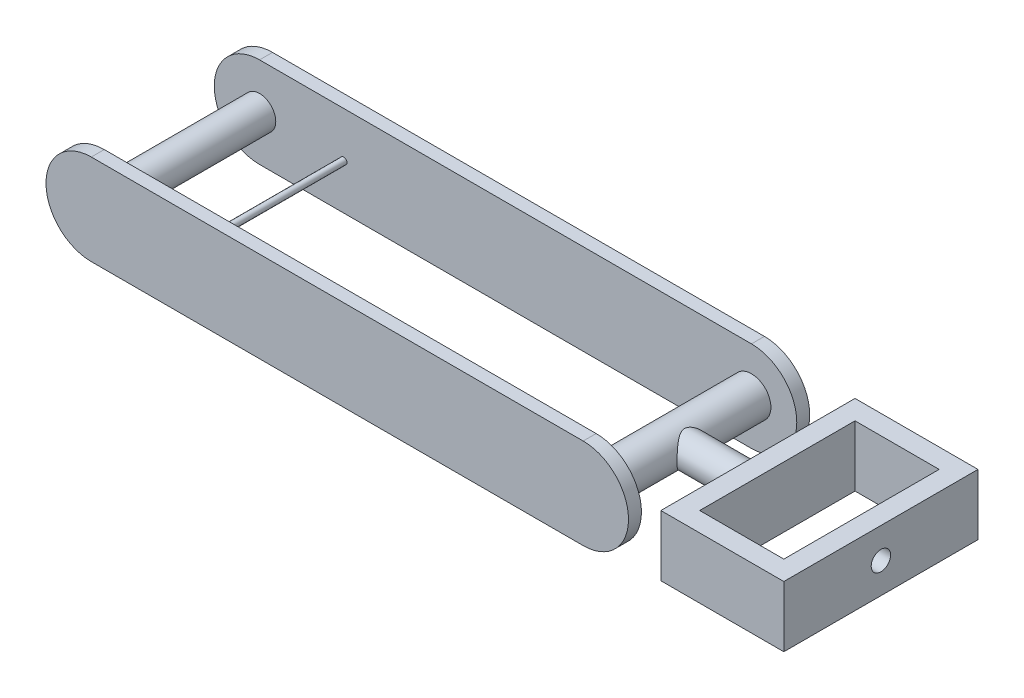
ISO-10303-21;
HEADER;
FILE_DESCRIPTION(('STEP AP214'),'2;1');
FILE_NAME('part.step','',(''),(''),'','','');
FILE_SCHEMA(('AUTOMOTIVE_DESIGN { 1 0 10303 214 1 1 1 1 }'));
ENDSEC;
DATA;
#1=APPLICATION_CONTEXT('core data for automotive mechanical design processes');
#2=APPLICATION_PROTOCOL_DEFINITION('international standard','automotive_design',2000,#1);
#3=PRODUCT_CONTEXT('',#1,'mechanical');
#4=PRODUCT('Part','Part','',(#3));
#5=PRODUCT_RELATED_PRODUCT_CATEGORY('part','',(#4));
#6=PRODUCT_DEFINITION_FORMATION('','',#4);
#7=PRODUCT_DEFINITION_CONTEXT('part definition',#1,'design');
#8=PRODUCT_DEFINITION('design','',#6,#7);
#9=PRODUCT_DEFINITION_SHAPE('','',#8);
#10=(LENGTH_UNIT() NAMED_UNIT(*) SI_UNIT(.MILLI.,.METRE.));
#11=(NAMED_UNIT(*) PLANE_ANGLE_UNIT() SI_UNIT($,.RADIAN.));
#12=(NAMED_UNIT(*) SI_UNIT($,.STERADIAN.) SOLID_ANGLE_UNIT());
#13=UNCERTAINTY_MEASURE_WITH_UNIT(LENGTH_MEASURE(1.E-05),#10,'distance_accuracy_value','');
#14=(GEOMETRIC_REPRESENTATION_CONTEXT(3) GLOBAL_UNCERTAINTY_ASSIGNED_CONTEXT((#13)) GLOBAL_UNIT_ASSIGNED_CONTEXT((#10,
#11,#12)) REPRESENTATION_CONTEXT('',''));
#15=CARTESIAN_POINT('',(0.,0.,0.));
#16=DIRECTION('',(0.,0.,1.));
#17=DIRECTION('',(1.,0.,0.));
#18=AXIS2_PLACEMENT_3D('',#15,#16,#17);
#19=CARTESIAN_POINT('',(270.,0.,0.));
#20=DIRECTION('',(1.,0.,0.));
#21=DIRECTION('',(0.,0.,-1.));
#22=AXIS2_PLACEMENT_3D('',#19,#20,#21);
#23=PLANE('',#22);
#24=DIRECTION('',(0.,0.,1.));
#25=VECTOR('',#24,1.);
#26=CARTESIAN_POINT('',(270.,23.5028857665654,15.));
#27=LINE('',#26,#25);
#28=CARTESIAN_POINT('',(270.,23.5028857665654,-120.));
#29=VERTEX_POINT('',#28);
#30=CARTESIAN_POINT('',(270.,23.5028857665654,0.));
#31=VERTEX_POINT('',#30);
#32=EDGE_CURVE('E55',#29,#31,#27,.T.);
#33=ORIENTED_EDGE('',*,*,#32,.T.);
#34=DIRECTION('',(0.,1.,0.));
#35=VECTOR('',#34,1.);
#36=CARTESIAN_POINT('',(270.,23.5028857665654,0.));
#37=LINE('',#36,#35);
#38=CARTESIAN_POINT('',(270.,-23.5028857665654,0.));
#39=VERTEX_POINT('',#38);
#40=EDGE_CURVE('E190',#39,#31,#37,.T.);
#41=ORIENTED_EDGE('',*,*,#40,.F.);
#42=DIRECTION('',(0.,0.,-1.));
#43=VECTOR('',#42,1.);
#44=CARTESIAN_POINT('',(270.,-23.5028857665654,15.));
#45=LINE('',#44,#43);
#46=CARTESIAN_POINT('',(270.,-23.5028857665654,-120.));
#47=VERTEX_POINT('',#46);
#48=EDGE_CURVE('E216',#39,#47,#45,.T.);
#49=ORIENTED_EDGE('',*,*,#48,.T.);
#50=DIRECTION('',(0.,-1.,0.));
#51=VECTOR('',#50,1.);
#52=CARTESIAN_POINT('',(270.,23.5028857665654,-120.));
#53=LINE('',#52,#51);
#54=EDGE_CURVE('E60',#29,#47,#53,.T.);
#55=ORIENTED_EDGE('',*,*,#54,.F.);
#56=EDGE_LOOP('',(#33,#41,#49,#55));
#57=FACE_BOUND('',#56,.T.);
#58=ADVANCED_FACE('F35',(#57),#23,.T.);
#59=CARTESIAN_POINT('',(190.,0.,-135.));
#60=DIRECTION('',(0.,0.,1.));
#61=DIRECTION('',(1.,0.,0.));
#62=AXIS2_PLACEMENT_3D('',#59,#60,#61);
#63=CYLINDRICAL_SURFACE('',#62,15.);
#64=CARTESIAN_POINT('',(190.,0.,0.));
#65=DIRECTION('',(0.,0.,1.));
#66=DIRECTION('',(1.,0.,0.));
#67=AXIS2_PLACEMENT_3D('',#64,#65,#66);
#68=CIRCLE('',#67,15.);
#69=CARTESIAN_POINT('',(205.,0.,0.));
#70=VERTEX_POINT('',#69);
#71=EDGE_CURVE('E239',#70,#70,#68,.T.);
#72=ORIENTED_EDGE('',*,*,#71,.F.);
#73=EDGE_LOOP('',(#72));
#74=FACE_BOUND('',#73,.T.);
#75=CARTESIAN_POINT('',(190.,0.,-120.));
#76=DIRECTION('',(0.,0.,1.));
#77=DIRECTION('',(1.,0.,0.));
#78=AXIS2_PLACEMENT_3D('',#75,#76,#77);
#79=CIRCLE('',#78,15.);
#80=CARTESIAN_POINT('',(205.,0.,-120.));
#81=VERTEX_POINT('',#80);
#82=EDGE_CURVE('E11',#81,#81,#79,.T.);
#83=ORIENTED_EDGE('',*,*,#82,.T.);
#84=EDGE_LOOP('',(#83));
#85=FACE_BOUND('',#84,.T.);
#86=CARTESIAN_POINT('',(205.,0.,-72.5));
#87=CARTESIAN_POINT('',(204.999998371701,-0.296923312070165,-72.4999983275979));
#88=CARTESIAN_POINT('',(204.991164705842,-0.593871646199195,-72.4894018329695));
#89=CARTESIAN_POINT('',(204.956034656178,-1.18524340872442,-72.447212805508));
#90=CARTESIAN_POINT('',(204.929736270144,-1.47966654370057,-72.4156178653242));
#91=CARTESIAN_POINT('',(204.860266269011,-2.06374265528194,-72.3319931563993));
#92=CARTESIAN_POINT('',(204.817084670112,-2.3533927035332,-72.2799512963895));
#93=CARTESIAN_POINT('',(204.714800764778,-2.92559798223802,-72.1563384657553));
#94=CARTESIAN_POINT('',(204.655698558575,-3.20815325734586,-72.0847676180794));
#95=CARTESIAN_POINT('',(204.523187659335,-3.76268614115294,-71.9237184026342));
#96=CARTESIAN_POINT('',(204.449867868628,-4.03471749052371,-71.8343512259831));
#97=CARTESIAN_POINT('',(204.290054677579,-4.56858722555234,-71.6386789994061));
#98=CARTESIAN_POINT('',(204.203561531421,-4.83042580775938,-71.5323742762918));
#99=CARTESIAN_POINT('',(204.018836277633,-5.34288544828468,-71.3040820620138));
#100=CARTESIAN_POINT('',(203.920603116742,-5.59350549734941,-71.1820931636612));
#101=CARTESIAN_POINT('',(203.713869708538,-6.08279150482866,-70.923654693615));
#102=CARTESIAN_POINT('',(203.605367280507,-6.32145490767388,-70.7872020497486));
#103=CARTESIAN_POINT('',(203.338075304108,-6.87172088229642,-70.4483850957328));
#104=CARTESIAN_POINT('',(203.17545453985,-7.17791172318053,-70.2402216276011));
#105=CARTESIAN_POINT('',(202.837441225209,-7.76629297181084,-69.801503500115));
#106=CARTESIAN_POINT('',(202.662044357147,-8.04847519535036,-69.5709412622383));
#107=CARTESIAN_POINT('',(202.301675653156,-8.58921346069624,-69.0888367923333));
#108=CARTESIAN_POINT('',(202.116680823637,-8.84770823448303,-68.837243203882));
#109=CARTESIAN_POINT('',(201.741232095059,-9.34019959391544,-68.3150163796984));
#110=CARTESIAN_POINT('',(201.550778885876,-9.57419925821835,-68.0443855438202));
#111=CARTESIAN_POINT('',(201.164774101581,-10.0218125911242,-67.4796720379531));
#112=CARTESIAN_POINT('',(200.969193193611,-10.2349719764474,-67.1852494985208));
#113=CARTESIAN_POINT('',(200.58102139351,-10.635779118778,-66.5774445965482));
#114=CARTESIAN_POINT('',(200.388431521636,-10.8234183329756,-66.2640559356271));
#115=CARTESIAN_POINT('',(200.01253413583,-11.1720493988886,-65.6186794298319));
#116=CARTESIAN_POINT('',(199.82920548693,-11.3331040206685,-65.2867379478547));
#117=CARTESIAN_POINT('',(199.478865642887,-11.6276971295169,-64.6027317422976));
#118=CARTESIAN_POINT('',(199.311840608889,-11.7612590616547,-64.2506844944784));
#119=CARTESIAN_POINT('',(199.073775103908,-11.9447893738676,-63.6899185196501));
#120=CARTESIAN_POINT('',(198.993522355246,-12.0052217887659,-63.4884952061355));
#121=CARTESIAN_POINT('',(198.842863185301,-12.1166220639299,-63.0793544531677));
#122=CARTESIAN_POINT('',(198.772458044519,-12.1675886936254,-62.8716361994374));
#123=CARTESIAN_POINT('',(198.643827527056,-12.2593021614932,-62.4506756462035));
#124=CARTESIAN_POINT('',(198.585578660217,-12.3000687406315,-62.2374449123401));
#125=CARTESIAN_POINT('',(198.483359359285,-12.3707917006533,-61.8059008705967));
#126=CARTESIAN_POINT('',(198.439381395281,-12.4007537833624,-61.5875903084262));
#127=CARTESIAN_POINT('',(198.367243446033,-12.4495452539764,-61.1441939469247));
#128=CARTESIAN_POINT('',(198.339293001597,-12.4682273289794,-60.9190572020046));
#129=CARTESIAN_POINT('',(198.301620086038,-12.4933433691716,-60.4665792166438));
#130=CARTESIAN_POINT('',(198.291895910489,-12.4997784796336,-60.2392381843352));
#131=CARTESIAN_POINT('',(198.291245052142,-12.5002102366344,-59.7845144251356));
#132=CARTESIAN_POINT('',(198.300318409853,-12.4942068563681,-59.5571316981558));
#133=CARTESIAN_POINT('',(198.336725509777,-12.4699428329516,-59.1044997815582));
#134=CARTESIAN_POINT('',(198.364061476269,-12.4516806967561,-58.8792508552143));
#135=CARTESIAN_POINT('',(198.438468977785,-12.4013871265877,-58.4142077314187));
#136=CARTESIAN_POINT('',(198.48698971129,-12.368339027623,-58.1747572105566));
#137=CARTESIAN_POINT('',(198.601004732832,-12.2893260258258,-57.7021912335421));
#138=CARTESIAN_POINT('',(198.666501695062,-12.2433590878467,-57.4690767818819));
#139=CARTESIAN_POINT('',(198.884358627522,-12.0871786252073,-56.7793302848718));
#140=CARTESIAN_POINT('',(199.057885667278,-11.9588103853178,-56.3333868775472));
#141=CARTESIAN_POINT('',(199.400121789437,-11.6908057009429,-55.5607980488661));
#142=CARTESIAN_POINT('',(199.562519884555,-11.5588798811882,-55.2284432487063));
#143=CARTESIAN_POINT('',(199.901095784922,-11.2702170140679,-54.5817415017133));
#144=CARTESIAN_POINT('',(200.077281639965,-11.1134654170124,-54.2674052631092));
#145=CARTESIAN_POINT('',(200.437296955341,-10.7760769566678,-53.6558428971152));
#146=CARTESIAN_POINT('',(200.621136440959,-10.595408043873,-53.3586405102075));
#147=CARTESIAN_POINT('',(200.991317792789,-10.2108848026406,-52.7814107881587));
#148=CARTESIAN_POINT('',(201.177659149809,-10.007035130802,-52.5013800208832));
#149=CARTESIAN_POINT('',(201.558551642437,-9.56500977328087,-51.9443476725589));
#150=CARTESIAN_POINT('',(201.75302208606,-9.32559600390717,-51.6682715308868));
#151=CARTESIAN_POINT('',(202.136161247921,-8.82121968518678,-51.1359999198117));
#152=CARTESIAN_POINT('',(202.324829099856,-8.55625334512574,-50.8798074103437));
#153=CARTESIAN_POINT('',(202.692071296891,-8.00136408219443,-50.3893275337445));
#154=CARTESIAN_POINT('',(202.870663962417,-7.71148904588991,-50.1549998648594));
#155=CARTESIAN_POINT('',(203.214230757941,-7.10668450823462,-49.709913033647));
#156=CARTESIAN_POINT('',(203.379209482823,-6.79176353127315,-49.4991459107381));
#157=CARTESIAN_POINT('',(203.653426023975,-6.2176346352411,-49.1522177018552));
#158=CARTESIAN_POINT('',(203.766432324652,-5.96362185269395,-49.0104125242363));
#159=CARTESIAN_POINT('',(203.980690039762,-5.44239412631551,-48.7431765404263));
#160=CARTESIAN_POINT('',(204.081944228038,-5.17518231915554,-48.617741869441));
#161=CARTESIAN_POINT('',(204.270949972049,-4.62856137888215,-48.3847232730962));
#162=CARTESIAN_POINT('',(204.35870605634,-4.34915637709623,-48.2771333599435));
#163=CARTESIAN_POINT('',(204.519079172758,-3.77940562745317,-48.0812406439891));
#164=CARTESIAN_POINT('',(204.591695959461,-3.48905970232378,-47.9929381538529));
#165=CARTESIAN_POINT('',(204.720744271192,-2.89692909479523,-47.8364360285027));
#166=CARTESIAN_POINT('',(204.777045797691,-2.59507312032774,-47.7683977436454));
#167=CARTESIAN_POINT('',(204.871374758826,-1.98435462821096,-47.6546040365546));
#168=CARTESIAN_POINT('',(204.909402152686,-1.67549209492938,-47.6088486640414));
#169=CARTESIAN_POINT('',(204.966206651751,-1.05361006429704,-47.5405577528012));
#170=CARTESIAN_POINT('',(204.984993910822,-0.740592848002751,-47.5180099663779));
#171=CARTESIAN_POINT('',(205.002854164801,-0.113203263560394,-47.4965736431341));
#172=CARTESIAN_POINT('',(205.001929304781,0.201168953414227,-47.4976825319952));
#173=CARTESIAN_POINT('',(204.981696161456,0.79060011548165,-47.5219692160475));
#174=CARTESIAN_POINT('',(204.964606254983,1.06585154136056,-47.5424839172527));
#175=CARTESIAN_POINT('',(204.915545079175,1.61305798508727,-47.6014616140286));
#176=CARTESIAN_POINT('',(204.883575238428,1.88501331681409,-47.6399228865922));
#177=CARTESIAN_POINT('',(204.805379076242,2.42381386934888,-47.734196250107));
#178=CARTESIAN_POINT('',(204.75915199851,2.69065881827185,-47.7900092615061));
#179=CARTESIAN_POINT('',(204.653297357706,3.21762543938395,-47.9181777733851));
#180=CARTESIAN_POINT('',(204.593669135482,3.47774678016148,-47.9905340875724));
#181=CARTESIAN_POINT('',(204.461177633125,3.99325659297312,-48.1518859617141));
#182=CARTESIAN_POINT('',(204.388151451925,4.24853866763172,-48.2410867687762));
#183=CARTESIAN_POINT('',(204.230551107354,4.74978694571594,-48.4344596218394));
#184=CARTESIAN_POINT('',(204.145972490854,4.99574950980776,-48.5386374418628));
#185=CARTESIAN_POINT('',(203.966533015729,5.47740828299168,-48.7608567076133));
#186=CARTESIAN_POINT('',(203.871672688143,5.71310502142153,-48.8788974373629));
#187=CARTESIAN_POINT('',(203.672916307246,6.17367827294099,-49.127822158771));
#188=CARTESIAN_POINT('',(203.569018442126,6.39855260229653,-49.2587087263898));
#189=CARTESIAN_POINT('',(203.30497565287,6.93563147461021,-49.5938796622724));
#190=CARTESIAN_POINT('',(203.140536431951,7.24166688197109,-49.8047152452547));
#191=CARTESIAN_POINT('',(202.799019650162,7.82947873887673,-50.2488422210337));
#192=CARTESIAN_POINT('',(202.621937235499,8.11124577906875,-50.4821422501745));
#193=CARTESIAN_POINT('',(202.258325526052,8.65098932350783,-50.9698800851125));
#194=CARTESIAN_POINT('',(202.071770882149,8.90889614562889,-51.2243759190458));
#195=CARTESIAN_POINT('',(201.693459865489,9.3999489168883,-51.7525164776672));
#196=CARTESIAN_POINT('',(201.501704230693,9.63309835598112,-52.0261584943444));
#197=CARTESIAN_POINT('',(201.113518601247,10.0786170078215,-52.596965368896));
#198=CARTESIAN_POINT('',(200.917066370513,10.2905396238018,-52.8944635737279));
#199=CARTESIAN_POINT('',(200.527648904049,10.6885973181745,-53.5086318812001));
#200=CARTESIAN_POINT('',(200.334684944672,10.8747231172231,-53.8253088240476));
#201=CARTESIAN_POINT('',(199.958812217844,11.2199362721708,-54.4774253786667));
#202=CARTESIAN_POINT('',(199.775877830386,11.3790949218183,-54.8128123003227));
#203=CARTESIAN_POINT('',(199.427359684749,11.6694553397696,-55.5039893073902));
#204=CARTESIAN_POINT('',(199.261760098837,11.8006827261947,-55.8597603133224));
#205=CARTESIAN_POINT('',(199.028151166414,11.9792820500161,-56.4237232519923));
#206=CARTESIAN_POINT('',(198.950307746211,12.0374486237396,-56.6244660664345));
#207=CARTESIAN_POINT('',(198.804668661434,12.1443795281648,-57.0320973860599));
#208=CARTESIAN_POINT('',(198.736874223358,12.1931427113827,-57.2389866377347));
#209=CARTESIAN_POINT('',(198.613629175613,12.2805172481157,-57.6580761260167));
#210=CARTESIAN_POINT('',(198.558153882382,12.3191489305144,-57.8702647771761));
#211=CARTESIAN_POINT('',(198.461568664994,12.3856895519206,-58.2994668784666));
#212=CARTESIAN_POINT('',(198.420451244776,12.4136040869729,-58.5164777478415));
#213=CARTESIAN_POINT('',(198.354063964567,12.4583809597523,-58.956791875045));
#214=CARTESIAN_POINT('',(198.328991692122,12.4751056097857,-59.1801394865725));
#215=CARTESIAN_POINT('',(198.296857243678,12.4965012122632,-59.6287044667341));
#216=CARTESIAN_POINT('',(198.289793555612,12.5011731766954,-59.8539216767967));
#217=CARTESIAN_POINT('',(198.294083772243,12.4983270737914,-60.3041518108093));
#218=CARTESIAN_POINT('',(198.305441723836,12.4908063279404,-60.5291646790035));
#219=CARTESIAN_POINT('',(198.345927219792,12.46379069103,-60.9768524618738));
#220=CARTESIAN_POINT('',(198.375057111794,12.4442942179972,-61.1995270637158));
#221=CARTESIAN_POINT('',(198.453508919613,12.3911519168957,-61.664241527745));
#222=CARTESIAN_POINT('',(198.504646881454,12.3562231793168,-61.905826173806));
#223=CARTESIAN_POINT('',(198.623944763418,12.2732581037799,-62.382372952829));
#224=CARTESIAN_POINT('',(198.692107781689,12.2252193799733,-62.6173338717625));
#225=CARTESIAN_POINT('',(198.917875966513,12.0625723366001,-63.3122628075375));
#226=CARTESIAN_POINT('',(199.096550881533,11.9295650271176,-63.7611856087824));
#227=CARTESIAN_POINT('',(199.447642704068,11.6525333453672,-64.5390132849835));
#228=CARTESIAN_POINT('',(199.613894699768,11.5162973775245,-64.8737139384393));
#229=CARTESIAN_POINT('',(199.959755387225,11.2185266211043,-65.5247367936715));
#230=CARTESIAN_POINT('',(200.139371812583,11.0569771235912,-65.8410481625492));
#231=CARTESIAN_POINT('',(200.50577305729,10.7094647902715,-66.4561875728671));
#232=CARTESIAN_POINT('',(200.692567186157,10.5234694360212,-66.7549915463219));
#233=CARTESIAN_POINT('',(201.06812719211,10.1277334392379,-67.3349985115838));
#234=CARTESIAN_POINT('',(201.256892664641,9.917997584994,-67.6162050349664));
#235=CARTESIAN_POINT('',(201.641548358718,9.46399415869409,-68.1742570726183));
#236=CARTESIAN_POINT('',(201.837332770365,9.21853603299082,-68.4502089646831));
#237=CARTESIAN_POINT('',(202.222384825024,8.70156411318117,-68.9816587133723));
#238=CARTESIAN_POINT('',(202.411651437901,8.43004622578964,-69.237153345115));
#239=CARTESIAN_POINT('',(202.779269062304,7.86159349217994,-69.7255066960116));
#240=CARTESIAN_POINT('',(202.957640159085,7.56470799324311,-69.9584075623967));
#241=CARTESIAN_POINT('',(203.299820096829,6.94548776625934,-70.3997411526791));
#242=CARTESIAN_POINT('',(203.463634491628,6.62316283354524,-70.6081832181838));
#243=CARTESIAN_POINT('',(203.732620016409,6.04067606389045,-70.947262061244));
#244=CARTESIAN_POINT('',(203.841992932701,5.78602780920789,-71.0840702241094));
#245=CARTESIAN_POINT('',(204.048825658988,5.26396034941812,-71.3413118620988));
#246=CARTESIAN_POINT('',(204.146288132655,4.99654401846071,-71.4617489991489));
#247=CARTESIAN_POINT('',(204.327547172101,4.45018573917794,-71.684725829009));
#248=CARTESIAN_POINT('',(204.411357085745,4.17125538649907,-71.7872830097129));
#249=CARTESIAN_POINT('',(204.563812809964,3.60303104563923,-71.9731982666466));
#250=CARTESIAN_POINT('',(204.632460726333,3.31373850312028,-72.0565590090701));
#251=CARTESIAN_POINT('',(204.742865044818,2.7766496606156,-72.190292660109));
#252=CARTESIAN_POINT('',(204.787210161234,2.53017700409103,-72.2438657904865));
#253=CARTESIAN_POINT('',(204.863772424159,2.03263262674723,-72.3362230677459));
#254=CARTESIAN_POINT('',(204.895991213844,1.7815615338768,-72.3750092183442));
#255=CARTESIAN_POINT('',(204.947766313573,1.2762377807826,-72.4372833672727));
#256=CARTESIAN_POINT('',(204.967323145443,1.02198525211293,-72.4607719960472));
#257=CARTESIAN_POINT('',(204.993441472234,0.511828141985505,-72.4921319727408));
#258=CARTESIAN_POINT('',(205.000001403459,0.255923365456328,-72.5000014414724));
#259=CARTESIAN_POINT('',(205.,0.,-72.5));
#260=B_SPLINE_CURVE_WITH_KNOTS('',3,(#86,#87,#88,#89,#90,#91,#92,#93,#94,#95,#96,#97,#98,#99,
#100,#101,#102,#103,#104,#105,#106,#107,#108,#109,#110,#111,#112,#113,#114,#115,#116,#117,#118,
#119,#120,#121,#122,#123,#124,#125,#126,#127,#128,#129,#130,#131,#132,#133,#134,#135,#136,#137,
#138,#139,#140,#141,#142,#143,#144,#145,#146,#147,#148,#149,#150,#151,#152,#153,#154,#155,#156,
#157,#158,#159,#160,#161,#162,#163,#164,#165,#166,#167,#168,#169,#170,#171,#172,#173,#174,#175,
#176,#177,#178,#179,#180,#181,#182,#183,#184,#185,#186,#187,#188,#189,#190,#191,#192,#193,#194,
#195,#196,#197,#198,#199,#200,#201,#202,#203,#204,#205,#206,#207,#208,#209,#210,#211,#212,#213,
#214,#215,#216,#217,#218,#219,#220,#221,#222,#223,#224,#225,#226,#227,#228,#229,#230,#231,#232,
#233,#234,#235,#236,#237,#238,#239,#240,#241,#242,#243,#244,#245,#246,#247,#248,#249,#250,#251,
#252,#253,#254,#255,#256,#257,#258,#259),.UNSPECIFIED.,.T.,.F.,(4,2,2,2,2,2,2,2,2,2,2,2,2,2,2,2,
2,2,2,2,2,2,2,2,2,2,2,2,2,2,2,2,2,2,2,2,2,2,2,2,2,2,2,2,2,2,2,2,2,2,2,2,2,2,2,2,2,2,2,2,2,2,2,2,
2,2,2,2,2,2,2,2,2,2,2,2,2,2,2,2,2,2,2,2,2,2,4),(0.,0.890496327722693,1.78109476332718,
2.67222064816241,3.56334092287135,4.44905895797117,5.33475990512299,6.2205403731543,
7.10650936389579,8.3179326410379,9.52976723481379,10.7446526556018,11.9593852002437,
13.1964670656074,14.4339620269412,15.6684919413966,16.9019646781947,17.5768149755148,
18.2517529433473,18.9253743663625,19.5986397790479,20.280517637783,20.9623317276903,
21.6441472869178,22.3260459023995,23.064518044577,23.803106585934,25.2835918051768,
26.4604393187565,27.6379791194065,28.8171131197453,29.9960106702444,31.2366027627229,
32.4773791805205,33.7158214234631,34.9538439515602,35.8892843253318,36.8245034567352,
37.7594081384926,38.694327974727,39.6365043057087,40.5786827389826,41.5203636865945,
42.4619421610537,43.2905793946019,44.1191370890495,44.9477387430364,45.7763811618238,
46.615861377997,47.4556661075397,48.2954274827628,49.1353575997355,50.3527496263854,
51.5706115562677,52.7919247494843,54.0130655496141,55.2560617222418,56.4995038575998,
57.7396055671636,58.9785649261597,59.6472285655574,60.3159737495773,60.9833666467615,
61.6504105838739,62.3255183093789,63.0005693484887,63.6757687040191,64.3510572714401,
65.0980707831754,65.8452203325021,67.342834782357,68.5348053464573,69.7274711152124,
70.9217397635807,72.1157679642777,73.3684812213695,74.6213915689275,75.8719178397659,
77.1219649287634,78.0483459197857,78.9745193526003,79.8997817756927,80.8249156114599,
81.5924932314998,82.3599668035974,83.1274087444327,83.8949430128885),.UNSPECIFIED.);
#261=CARTESIAN_POINT('',(205.,0.,-72.5));
#262=VERTEX_POINT('',#261);
#263=EDGE_CURVE('E39',#262,#262,#260,.T.);
#264=ORIENTED_EDGE('',*,*,#263,.T.);
#265=EDGE_LOOP('',(#264));
#266=FACE_BOUND('',#265,.T.);
#267=ADVANCED_FACE('F367',(#74,#85,#266),#63,.T.);
#268=CARTESIAN_POINT('',(-190.,0.,10.));
#269=DIRECTION('',(0.,0.,-1.));
#270=DIRECTION('',(-1.,0.,0.));
#271=AXIS2_PLACEMENT_3D('',#268,#269,#270);
#272=CYLINDRICAL_SURFACE('',#271,35.);
#273=CARTESIAN_POINT('',(-190.,0.,0.));
#274=DIRECTION('',(0.,0.,1.));
#275=DIRECTION('',(1.,0.,0.));
#276=AXIS2_PLACEMENT_3D('',#273,#274,#275);
#277=CIRCLE('',#276,35.);
#278=CARTESIAN_POINT('',(-190.,35.,0.));
#279=VERTEX_POINT('',#278);
#280=CARTESIAN_POINT('',(-190.,-35.,0.));
#281=VERTEX_POINT('',#280);
#282=EDGE_CURVE('E299',#279,#281,#277,.T.);
#283=ORIENTED_EDGE('',*,*,#282,.T.);
#284=DIRECTION('',(0.,0.,-1.));
#285=VECTOR('',#284,1.);
#286=CARTESIAN_POINT('',(-190.,-35.,10.));
#287=LINE('',#286,#285);
#288=CARTESIAN_POINT('',(-190.,-35.,10.));
#289=VERTEX_POINT('',#288);
#290=EDGE_CURVE('E315',#289,#281,#287,.T.);
#291=ORIENTED_EDGE('',*,*,#290,.F.);
#292=CARTESIAN_POINT('',(-190.,0.,10.));
#293=DIRECTION('',(0.,0.,1.));
#294=DIRECTION('',(1.,0.,0.));
#295=AXIS2_PLACEMENT_3D('',#292,#293,#294);
#296=CIRCLE('',#295,35.);
#297=CARTESIAN_POINT('',(-190.,35.,10.));
#298=VERTEX_POINT('',#297);
#299=EDGE_CURVE('E288',#298,#289,#296,.T.);
#300=ORIENTED_EDGE('',*,*,#299,.F.);
#301=DIRECTION('',(0.,0.,-1.));
#302=VECTOR('',#301,1.);
#303=CARTESIAN_POINT('',(-190.,35.,10.));
#304=LINE('',#303,#302);
#305=EDGE_CURVE('E298',#298,#279,#304,.T.);
#306=ORIENTED_EDGE('',*,*,#305,.T.);
#307=EDGE_LOOP('',(#283,#291,#300,#306));
#308=FACE_BOUND('',#307,.T.);
#309=ADVANCED_FACE('F37',(#308),#272,.T.);
#310=CARTESIAN_POINT('',(-190.,-35.,10.));
#311=DIRECTION('',(0.,1.,0.));
#312=DIRECTION('',(0.,0.,1.));
#313=AXIS2_PLACEMENT_3D('',#310,#311,#312);
#314=PLANE('',#313);
#315=DIRECTION('',(1.,0.,0.));
#316=VECTOR('',#315,1.);
#317=CARTESIAN_POINT('',(-190.,-35.,0.));
#318=LINE('',#317,#316);
#319=CARTESIAN_POINT('',(190.,-35.,0.));
#320=VERTEX_POINT('',#319);
#321=EDGE_CURVE('E302',#281,#320,#318,.T.);
#322=ORIENTED_EDGE('',*,*,#321,.T.);
#323=DIRECTION('',(0.,0.,-1.));
#324=VECTOR('',#323,1.);
#325=CARTESIAN_POINT('',(190.,-35.,10.));
#326=LINE('',#325,#324);
#327=CARTESIAN_POINT('',(190.,-35.,10.));
#328=VERTEX_POINT('',#327);
#329=EDGE_CURVE('E312',#328,#320,#326,.T.);
#330=ORIENTED_EDGE('',*,*,#329,.F.);
#331=DIRECTION('',(1.,0.,0.));
#332=VECTOR('',#331,1.);
#333=CARTESIAN_POINT('',(-190.,-35.,10.));
#334=LINE('',#333,#332);
#335=EDGE_CURVE('E291',#289,#328,#334,.T.);
#336=ORIENTED_EDGE('',*,*,#335,.F.);
#337=ORIENTED_EDGE('',*,*,#290,.T.);
#338=EDGE_LOOP('',(#322,#330,#336,#337));
#339=FACE_BOUND('',#338,.T.);
#340=ADVANCED_FACE('F455',(#339),#314,.F.);
#341=CARTESIAN_POINT('',(190.,0.,10.));
#342=DIRECTION('',(0.,0.,-1.));
#343=DIRECTION('',(-1.,0.,0.));
#344=AXIS2_PLACEMENT_3D('',#341,#342,#343);
#345=CYLINDRICAL_SURFACE('',#344,35.);
#346=CARTESIAN_POINT('',(190.,0.,0.));
#347=DIRECTION('',(0.,0.,1.));
#348=DIRECTION('',(1.,0.,0.));
#349=AXIS2_PLACEMENT_3D('',#346,#347,#348);
#350=CIRCLE('',#349,35.);
#351=CARTESIAN_POINT('',(190.,35.,0.));
#352=VERTEX_POINT('',#351);
#353=EDGE_CURVE('E304',#320,#352,#350,.T.);
#354=ORIENTED_EDGE('',*,*,#353,.T.);
#355=DIRECTION('',(0.,0.,-1.));
#356=VECTOR('',#355,1.);
#357=CARTESIAN_POINT('',(190.,35.,10.));
#358=LINE('',#357,#356);
#359=CARTESIAN_POINT('',(190.,35.,10.));
#360=VERTEX_POINT('',#359);
#361=EDGE_CURVE('E309',#360,#352,#358,.T.);
#362=ORIENTED_EDGE('',*,*,#361,.F.);
#363=CARTESIAN_POINT('',(190.,0.,10.));
#364=DIRECTION('',(0.,0.,1.));
#365=DIRECTION('',(1.,0.,0.));
#366=AXIS2_PLACEMENT_3D('',#363,#364,#365);
#367=CIRCLE('',#366,35.);
#368=EDGE_CURVE('E294',#328,#360,#367,.T.);
#369=ORIENTED_EDGE('',*,*,#368,.F.);
#370=ORIENTED_EDGE('',*,*,#329,.T.);
#371=EDGE_LOOP('',(#354,#362,#369,#370));
#372=FACE_BOUND('',#371,.T.);
#373=ADVANCED_FACE('F452',(#372),#345,.T.);
#374=CARTESIAN_POINT('',(-190.,35.,10.));
#375=DIRECTION('',(0.,-1.,0.));
#376=DIRECTION('',(0.,0.,-1.));
#377=AXIS2_PLACEMENT_3D('',#374,#375,#376);
#378=PLANE('',#377);
#379=DIRECTION('',(-1.,0.,0.));
#380=VECTOR('',#379,1.);
#381=CARTESIAN_POINT('',(-190.,35.,0.));
#382=LINE('',#381,#380);
#383=EDGE_CURVE('E292',#352,#279,#382,.T.);
#384=ORIENTED_EDGE('',*,*,#383,.T.);
#385=ORIENTED_EDGE('',*,*,#305,.F.);
#386=DIRECTION('',(-1.,0.,0.));
#387=VECTOR('',#386,1.);
#388=CARTESIAN_POINT('',(-190.,35.,10.));
#389=LINE('',#388,#387);
#390=EDGE_CURVE('E296',#360,#298,#389,.T.);
#391=ORIENTED_EDGE('',*,*,#390,.F.);
#392=ORIENTED_EDGE('',*,*,#361,.T.);
#393=EDGE_LOOP('',(#384,#385,#391,#392));
#394=FACE_BOUND('',#393,.T.);
#395=ADVANCED_FACE('F448',(#394),#378,.F.);
#396=CARTESIAN_POINT('',(-190.,0.,10.));
#397=DIRECTION('',(0.,0.,1.));
#398=DIRECTION('',(1.,0.,0.));
#399=AXIS2_PLACEMENT_3D('',#396,#397,#398);
#400=PLANE('',#399);
#401=ORIENTED_EDGE('',*,*,#299,.T.);
#402=ORIENTED_EDGE('',*,*,#335,.T.);
#403=ORIENTED_EDGE('',*,*,#368,.T.);
#404=ORIENTED_EDGE('',*,*,#390,.T.);
#405=EDGE_LOOP('',(#401,#402,#403,#404));
#406=FACE_BOUND('',#405,.T.);
#407=ADVANCED_FACE('F432',(#406),#400,.T.);
#408=CARTESIAN_POINT('',(-190.,0.,0.));
#409=DIRECTION('',(0.,0.,1.));
#410=DIRECTION('',(1.,0.,0.));
#411=AXIS2_PLACEMENT_3D('',#408,#409,#410);
#412=PLANE('',#411);
#413=ORIENTED_EDGE('',*,*,#71,.T.);
#414=EDGE_LOOP('',(#413));
#415=FACE_BOUND('',#414,.T.);
#416=CARTESIAN_POINT('',(-125.,0.,0.));
#417=DIRECTION('',(0.,0.,1.));
#418=DIRECTION('',(1.,0.,0.));
#419=AXIS2_PLACEMENT_3D('',#416,#417,#418);
#420=CIRCLE('',#419,2.5);
#421=CARTESIAN_POINT('',(-122.5,0.,0.));
#422=VERTEX_POINT('',#421);
#423=EDGE_CURVE('E248',#422,#422,#420,.T.);
#424=ORIENTED_EDGE('',*,*,#423,.T.);
#425=EDGE_LOOP('',(#424));
#426=FACE_BOUND('',#425,.T.);
#427=CARTESIAN_POINT('',(-190.,0.,0.));
#428=DIRECTION('',(0.,0.,1.));
#429=DIRECTION('',(1.,0.,0.));
#430=AXIS2_PLACEMENT_3D('',#427,#428,#429);
#431=CIRCLE('',#430,12.5);
#432=CARTESIAN_POINT('',(-177.5,0.,0.));
#433=VERTEX_POINT('',#432);
#434=EDGE_CURVE('E287',#433,#433,#431,.T.);
#435=ORIENTED_EDGE('',*,*,#434,.T.);
#436=EDGE_LOOP('',(#435));
#437=FACE_BOUND('',#436,.T.);
#438=ORIENTED_EDGE('',*,*,#282,.F.);
#439=ORIENTED_EDGE('',*,*,#383,.F.);
#440=ORIENTED_EDGE('',*,*,#353,.F.);
#441=ORIENTED_EDGE('',*,*,#321,.F.);
#442=EDGE_LOOP('',(#438,#439,#440,#441));
#443=FACE_BOUND('',#442,.T.);
#444=ADVANCED_FACE('F425',(#415,#426,#437,#443),#412,.F.);
#445=CARTESIAN_POINT('',(-190.,0.,-135.));
#446=DIRECTION('',(0.,0.,1.));
#447=DIRECTION('',(1.,0.,0.));
#448=AXIS2_PLACEMENT_3D('',#445,#446,#447);
#449=CYLINDRICAL_SURFACE('',#448,12.5);
#450=CARTESIAN_POINT('',(-190.,0.,-120.));
#451=DIRECTION('',(0.,0.,1.));
#452=DIRECTION('',(1.,0.,0.));
#453=AXIS2_PLACEMENT_3D('',#450,#451,#452);
#454=CIRCLE('',#453,12.5);
#455=CARTESIAN_POINT('',(-177.5,0.,-120.));
#456=VERTEX_POINT('',#455);
#457=EDGE_CURVE('E318',#456,#456,#454,.F.);
#458=ORIENTED_EDGE('',*,*,#457,.F.);
#459=EDGE_LOOP('',(#458));
#460=FACE_BOUND('',#459,.T.);
#461=ORIENTED_EDGE('',*,*,#434,.F.);
#462=EDGE_LOOP('',(#461));
#463=FACE_BOUND('',#462,.T.);
#464=ADVANCED_FACE('F416',(#460,#463),#449,.T.);
#465=CARTESIAN_POINT('',(-190.,0.,-130.));
#466=DIRECTION('',(0.,0.,1.));
#467=DIRECTION('',(1.,0.,0.));
#468=AXIS2_PLACEMENT_3D('',#465,#466,#467);
#469=CYLINDRICAL_SURFACE('',#468,34.9999999999999);
#470=CARTESIAN_POINT('',(-190.,0.,-120.));
#471=DIRECTION('',(0.,0.,1.));
#472=DIRECTION('',(1.,0.,0.));
#473=AXIS2_PLACEMENT_3D('',#470,#471,#472);
#474=CIRCLE('',#473,34.9999999999999);
#475=CARTESIAN_POINT('',(-190.,34.9999999999999,-120.));
#476=VERTEX_POINT('',#475);
#477=CARTESIAN_POINT('',(-190.,-34.9999999999999,-120.));
#478=VERTEX_POINT('',#477);
#479=EDGE_CURVE('E251',#476,#478,#474,.T.);
#480=ORIENTED_EDGE('',*,*,#479,.F.);
#481=DIRECTION('',(0.,0.,1.));
#482=VECTOR('',#481,1.);
#483=CARTESIAN_POINT('',(-190.,34.9999999999999,-130.));
#484=LINE('',#483,#482);
#485=CARTESIAN_POINT('',(-190.,34.9999999999999,-130.));
#486=VERTEX_POINT('',#485);
#487=EDGE_CURVE('E276',#486,#476,#484,.T.);
#488=ORIENTED_EDGE('',*,*,#487,.F.);
#489=CARTESIAN_POINT('',(-190.,0.,-130.));
#490=DIRECTION('',(0.,0.,1.));
#491=DIRECTION('',(1.,0.,0.));
#492=AXIS2_PLACEMENT_3D('',#489,#490,#491);
#493=CIRCLE('',#492,34.9999999999999);
#494=CARTESIAN_POINT('',(-190.,-34.9999999999999,-130.));
#495=VERTEX_POINT('',#494);
#496=EDGE_CURVE('E252',#486,#495,#493,.T.);
#497=ORIENTED_EDGE('',*,*,#496,.T.);
#498=DIRECTION('',(0.,0.,1.));
#499=VECTOR('',#498,1.);
#500=CARTESIAN_POINT('',(-190.,-34.9999999999999,-130.));
#501=LINE('',#500,#499);
#502=EDGE_CURVE('E265',#495,#478,#501,.T.);
#503=ORIENTED_EDGE('',*,*,#502,.T.);
#504=EDGE_LOOP('',(#480,#488,#497,#503));
#505=FACE_BOUND('',#504,.T.);
#506=ADVANCED_FACE('F344',(#505),#469,.T.);
#507=CARTESIAN_POINT('',(-190.,34.9999999999999,-130.));
#508=DIRECTION('',(0.,1.,0.));
#509=DIRECTION('',(-1.,0.,0.));
#510=AXIS2_PLACEMENT_3D('',#507,#508,#509);
#511=PLANE('',#510);
#512=DIRECTION('',(-1.,0.,0.));
#513=VECTOR('',#512,1.);
#514=CARTESIAN_POINT('',(-190.,34.9999999999999,-120.));
#515=LINE('',#514,#513);
#516=CARTESIAN_POINT('',(190.,35.,-120.));
#517=VERTEX_POINT('',#516);
#518=EDGE_CURVE('E256',#517,#476,#515,.T.);
#519=ORIENTED_EDGE('',*,*,#518,.F.);
#520=DIRECTION('',(0.,0.,1.));
#521=VECTOR('',#520,1.);
#522=CARTESIAN_POINT('',(190.,35.,-130.));
#523=LINE('',#522,#521);
#524=CARTESIAN_POINT('',(190.,35.,-130.));
#525=VERTEX_POINT('',#524);
#526=EDGE_CURVE('E279',#525,#517,#523,.T.);
#527=ORIENTED_EDGE('',*,*,#526,.F.);
#528=DIRECTION('',(-1.,0.,0.));
#529=VECTOR('',#528,1.);
#530=CARTESIAN_POINT('',(-190.,34.9999999999999,-130.));
#531=LINE('',#530,#529);
#532=EDGE_CURVE('E262',#525,#486,#531,.T.);
#533=ORIENTED_EDGE('',*,*,#532,.T.);
#534=ORIENTED_EDGE('',*,*,#487,.T.);
#535=EDGE_LOOP('',(#519,#527,#533,#534));
#536=FACE_BOUND('',#535,.T.);
#537=ADVANCED_FACE('F354',(#536),#511,.T.);
#538=CARTESIAN_POINT('',(190.,0.,-130.));
#539=DIRECTION('',(0.,0.,1.));
#540=DIRECTION('',(1.,0.,0.));
#541=AXIS2_PLACEMENT_3D('',#538,#539,#540);
#542=CYLINDRICAL_SURFACE('',#541,34.9999999999999);
#543=CARTESIAN_POINT('',(190.,0.,-120.));
#544=DIRECTION('',(0.,0.,1.));
#545=DIRECTION('',(1.,0.,0.));
#546=AXIS2_PLACEMENT_3D('',#543,#544,#545);
#547=CIRCLE('',#546,34.9999999999999);
#548=CARTESIAN_POINT('',(190.,-34.9999999999999,-120.));
#549=VERTEX_POINT('',#548);
#550=EDGE_CURVE('E271',#549,#517,#547,.T.);
#551=ORIENTED_EDGE('',*,*,#550,.F.);
#552=DIRECTION('',(0.,0.,1.));
#553=VECTOR('',#552,1.);
#554=CARTESIAN_POINT('',(190.,-34.9999999999999,-130.));
#555=LINE('',#554,#553);
#556=CARTESIAN_POINT('',(190.,-34.9999999999999,-130.));
#557=VERTEX_POINT('',#556);
#558=EDGE_CURVE('E281',#557,#549,#555,.T.);
#559=ORIENTED_EDGE('',*,*,#558,.F.);
#560=CARTESIAN_POINT('',(190.,0.,-130.));
#561=DIRECTION('',(0.,0.,1.));
#562=DIRECTION('',(1.,0.,0.));
#563=AXIS2_PLACEMENT_3D('',#560,#561,#562);
#564=CIRCLE('',#563,34.9999999999999);
#565=EDGE_CURVE('E259',#557,#525,#564,.T.);
#566=ORIENTED_EDGE('',*,*,#565,.T.);
#567=ORIENTED_EDGE('',*,*,#526,.T.);
#568=EDGE_LOOP('',(#551,#559,#566,#567));
#569=FACE_BOUND('',#568,.T.);
#570=ADVANCED_FACE('F352',(#569),#542,.T.);
#571=CARTESIAN_POINT('',(-190.,-34.9999999999999,-130.));
#572=DIRECTION('',(0.,-1.,0.));
#573=DIRECTION('',(1.,0.,0.));
#574=AXIS2_PLACEMENT_3D('',#571,#572,#573);
#575=PLANE('',#574);
#576=DIRECTION('',(1.,0.,0.));
#577=VECTOR('',#576,1.);
#578=CARTESIAN_POINT('',(-190.,-34.9999999999999,-120.));
#579=LINE('',#578,#577);
#580=EDGE_CURVE('E268',#478,#549,#579,.T.);
#581=ORIENTED_EDGE('',*,*,#580,.F.);
#582=ORIENTED_EDGE('',*,*,#502,.F.);
#583=DIRECTION('',(1.,0.,0.));
#584=VECTOR('',#583,1.);
#585=CARTESIAN_POINT('',(-190.,-34.9999999999999,-130.));
#586=LINE('',#585,#584);
#587=EDGE_CURVE('E255',#495,#557,#586,.T.);
#588=ORIENTED_EDGE('',*,*,#587,.T.);
#589=ORIENTED_EDGE('',*,*,#558,.T.);
#590=EDGE_LOOP('',(#581,#582,#588,#589));
#591=FACE_BOUND('',#590,.T.);
#592=ADVANCED_FACE('F348',(#591),#575,.T.);
#593=CARTESIAN_POINT('',(-190.,0.,-130.));
#594=DIRECTION('',(0.,0.,1.));
#595=DIRECTION('',(1.,0.,0.));
#596=AXIS2_PLACEMENT_3D('',#593,#594,#595);
#597=PLANE('',#596);
#598=CARTESIAN_POINT('',(190.,0.,-130.));
#599=DIRECTION('',(0.,0.,1.));
#600=DIRECTION('',(1.,0.,0.));
#601=AXIS2_PLACEMENT_3D('',#598,#599,#600);
#602=CIRCLE('',#601,15.);
#603=CARTESIAN_POINT('',(205.,0.,-130.));
#604=VERTEX_POINT('',#603);
#605=EDGE_CURVE('E236',#604,#604,#602,.T.);
#606=ORIENTED_EDGE('',*,*,#605,.T.);
#607=EDGE_LOOP('',(#606));
#608=FACE_BOUND('',#607,.T.);
#609=CARTESIAN_POINT('',(-125.,0.,-130.));
#610=DIRECTION('',(0.,0.,1.));
#611=DIRECTION('',(1.,0.,0.));
#612=AXIS2_PLACEMENT_3D('',#609,#610,#611);
#613=CIRCLE('',#612,2.5);
#614=CARTESIAN_POINT('',(-122.5,0.,-130.));
#615=VERTEX_POINT('',#614);
#616=EDGE_CURVE('E245',#615,#615,#613,.T.);
#617=ORIENTED_EDGE('',*,*,#616,.T.);
#618=EDGE_LOOP('',(#617));
#619=FACE_BOUND('',#618,.T.);
#620=CARTESIAN_POINT('',(-190.,0.,-130.));
#621=DIRECTION('',(0.,0.,1.));
#622=DIRECTION('',(1.,0.,0.));
#623=AXIS2_PLACEMENT_3D('',#620,#621,#622);
#624=CIRCLE('',#623,12.5);
#625=CARTESIAN_POINT('',(-177.5,0.,-130.));
#626=VERTEX_POINT('',#625);
#627=EDGE_CURVE('E278',#626,#626,#624,.F.);
#628=ORIENTED_EDGE('',*,*,#627,.F.);
#629=EDGE_LOOP('',(#628));
#630=FACE_BOUND('',#629,.T.);
#631=ORIENTED_EDGE('',*,*,#496,.F.);
#632=ORIENTED_EDGE('',*,*,#532,.F.);
#633=ORIENTED_EDGE('',*,*,#565,.F.);
#634=ORIENTED_EDGE('',*,*,#587,.F.);
#635=EDGE_LOOP('',(#631,#632,#633,#634));
#636=FACE_BOUND('',#635,.T.);
#637=ADVANCED_FACE('F335',(#608,#619,#630,#636),#597,.F.);
#638=CARTESIAN_POINT('',(-190.,0.,-120.));
#639=DIRECTION('',(0.,0.,1.));
#640=DIRECTION('',(1.,0.,0.));
#641=AXIS2_PLACEMENT_3D('',#638,#639,#640);
#642=PLANE('',#641);
#643=ORIENTED_EDGE('',*,*,#82,.F.);
#644=EDGE_LOOP('',(#643));
#645=FACE_BOUND('',#644,.T.);
#646=CARTESIAN_POINT('',(-125.,0.,-120.));
#647=DIRECTION('',(0.,0.,1.));
#648=DIRECTION('',(1.,0.,0.));
#649=AXIS2_PLACEMENT_3D('',#646,#647,#648);
#650=CIRCLE('',#649,2.5);
#651=CARTESIAN_POINT('',(-122.5,0.,-120.));
#652=VERTEX_POINT('',#651);
#653=EDGE_CURVE('E48',#652,#652,#650,.T.);
#654=ORIENTED_EDGE('',*,*,#653,.F.);
#655=EDGE_LOOP('',(#654));
#656=FACE_BOUND('',#655,.T.);
#657=ORIENTED_EDGE('',*,*,#457,.T.);
#658=EDGE_LOOP('',(#657));
#659=FACE_BOUND('',#658,.T.);
#660=ORIENTED_EDGE('',*,*,#479,.T.);
#661=ORIENTED_EDGE('',*,*,#580,.T.);
#662=ORIENTED_EDGE('',*,*,#550,.T.);
#663=ORIENTED_EDGE('',*,*,#518,.T.);
#664=EDGE_LOOP('',(#660,#661,#662,#663));
#665=FACE_BOUND('',#664,.T.);
#666=ADVANCED_FACE('F331',(#645,#656,#659,#665),#642,.T.);
#667=CARTESIAN_POINT('',(-190.,0.,-135.));
#668=DIRECTION('',(0.,0.,1.));
#669=DIRECTION('',(1.,0.,0.));
#670=AXIS2_PLACEMENT_3D('',#667,#668,#669);
#671=PLANE('',#670);
#672=CARTESIAN_POINT('',(-190.,0.,-135.));
#673=DIRECTION('',(0.,0.,1.));
#674=DIRECTION('',(1.,0.,0.));
#675=AXIS2_PLACEMENT_3D('',#672,#673,#674);
#676=CIRCLE('',#675,12.5);
#677=CARTESIAN_POINT('',(-177.5,0.,-135.));
#678=VERTEX_POINT('',#677);
#679=EDGE_CURVE('E284',#678,#678,#676,.T.);
#680=ORIENTED_EDGE('',*,*,#679,.F.);
#681=EDGE_LOOP('',(#680));
#682=FACE_BOUND('',#681,.T.);
#683=ADVANCED_FACE('F334',(#682),#671,.F.);
#684=ORIENTED_EDGE('',*,*,#679,.T.);
#685=EDGE_LOOP('',(#684));
#686=FACE_BOUND('',#685,.T.);
#687=ORIENTED_EDGE('',*,*,#627,.T.);
#688=EDGE_LOOP('',(#687));
#689=FACE_BOUND('',#688,.T.);
#690=ADVANCED_FACE('F408',(#686,#689),#449,.T.);
#691=CARTESIAN_POINT('',(-125.,0.,-135.));
#692=DIRECTION('',(0.,0.,1.));
#693=DIRECTION('',(1.,0.,0.));
#694=AXIS2_PLACEMENT_3D('',#691,#692,#693);
#695=CYLINDRICAL_SURFACE('',#694,2.5);
#696=ORIENTED_EDGE('',*,*,#653,.T.);
#697=EDGE_LOOP('',(#696));
#698=FACE_BOUND('',#697,.T.);
#699=ORIENTED_EDGE('',*,*,#423,.F.);
#700=EDGE_LOOP('',(#699));
#701=FACE_BOUND('',#700,.T.);
#702=ADVANCED_FACE('F328',(#698,#701),#695,.T.);
#703=CARTESIAN_POINT('',(-125.,0.,-135.));
#704=DIRECTION('',(0.,0.,1.));
#705=DIRECTION('',(1.,0.,0.));
#706=AXIS2_PLACEMENT_3D('',#703,#704,#705);
#707=CIRCLE('',#706,2.5);
#708=CARTESIAN_POINT('',(-122.5,0.,-135.));
#709=VERTEX_POINT('',#708);
#710=EDGE_CURVE('E242',#709,#709,#707,.T.);
#711=ORIENTED_EDGE('',*,*,#710,.T.);
#712=EDGE_LOOP('',(#711));
#713=FACE_BOUND('',#712,.T.);
#714=ORIENTED_EDGE('',*,*,#616,.F.);
#715=EDGE_LOOP('',(#714));
#716=FACE_BOUND('',#715,.T.);
#717=ADVANCED_FACE('F405',(#713,#716),#695,.T.);
#718=CARTESIAN_POINT('',(-125.,0.,-135.));
#719=DIRECTION('',(0.,0.,1.));
#720=DIRECTION('',(1.,0.,0.));
#721=AXIS2_PLACEMENT_3D('',#718,#719,#720);
#722=PLANE('',#721);
#723=ORIENTED_EDGE('',*,*,#710,.F.);
#724=EDGE_LOOP('',(#723));
#725=FACE_BOUND('',#724,.T.);
#726=ADVANCED_FACE('F403',(#725),#722,.F.);
#727=CARTESIAN_POINT('',(190.,0.,-135.));
#728=DIRECTION('',(0.,0.,1.));
#729=DIRECTION('',(1.,0.,0.));
#730=AXIS2_PLACEMENT_3D('',#727,#728,#729);
#731=CIRCLE('',#730,15.);
#732=CARTESIAN_POINT('',(205.,0.,-135.));
#733=VERTEX_POINT('',#732);
#734=EDGE_CURVE('E233',#733,#733,#731,.T.);
#735=ORIENTED_EDGE('',*,*,#734,.T.);
#736=EDGE_LOOP('',(#735));
#737=FACE_BOUND('',#736,.T.);
#738=ORIENTED_EDGE('',*,*,#605,.F.);
#739=EDGE_LOOP('',(#738));
#740=FACE_BOUND('',#739,.T.);
#741=ADVANCED_FACE('F373',(#737,#740),#63,.T.);
#742=CARTESIAN_POINT('',(190.,0.,-135.));
#743=DIRECTION('',(0.,0.,1.));
#744=DIRECTION('',(1.,0.,0.));
#745=AXIS2_PLACEMENT_3D('',#742,#743,#744);
#746=PLANE('',#745);
#747=ORIENTED_EDGE('',*,*,#734,.F.);
#748=EDGE_LOOP('',(#747));
#749=FACE_BOUND('',#748,.T.);
#750=ADVANCED_FACE('F397',(#749),#746,.F.);
#751=CARTESIAN_POINT('',(255.,0.,-60.));
#752=DIRECTION('',(-1.,0.,0.));
#753=DIRECTION('',(0.,0.,1.));
#754=AXIS2_PLACEMENT_3D('',#751,#752,#753);
#755=CYLINDRICAL_SURFACE('',#754,12.5);
#756=ORIENTED_EDGE('',*,*,#263,.F.);
#757=EDGE_LOOP('',(#756));
#758=FACE_BOUND('',#757,.T.);
#759=CARTESIAN_POINT('',(255.,0.,-60.));
#760=DIRECTION('',(1.,0.,0.));
#761=DIRECTION('',(0.,0.,-1.));
#762=AXIS2_PLACEMENT_3D('',#759,#760,#761);
#763=CIRCLE('',#762,12.5);
#764=CARTESIAN_POINT('',(255.,0.,-72.5));
#765=VERTEX_POINT('',#764);
#766=EDGE_CURVE('E230',#765,#765,#763,.T.);
#767=ORIENTED_EDGE('',*,*,#766,.F.);
#768=EDGE_LOOP('',(#767));
#769=FACE_BOUND('',#768,.T.);
#770=ADVANCED_FACE('F392',(#758,#769),#755,.T.);
#771=CARTESIAN_POINT('',(270.,23.5028857665654,-135.));
#772=DIRECTION('',(0.,0.,1.));
#773=DIRECTION('',(1.,0.,0.));
#774=AXIS2_PLACEMENT_3D('',#771,#772,#773);
#775=PLANE('',#774);
#776=DIRECTION('',(0.,1.,0.));
#777=VECTOR('',#776,1.);
#778=CARTESIAN_POINT('',(255.,23.5028857665654,-135.));
#779=LINE('',#778,#777);
#780=CARTESIAN_POINT('',(255.,-23.5028857665654,-135.));
#781=VERTEX_POINT('',#780);
#782=CARTESIAN_POINT('',(255.,23.5028857665654,-135.));
#783=VERTEX_POINT('',#782);
#784=EDGE_CURVE('E214',#781,#783,#779,.T.);
#785=ORIENTED_EDGE('',*,*,#784,.T.);
#786=DIRECTION('',(-1.,0.,0.));
#787=VECTOR('',#786,1.);
#788=CARTESIAN_POINT('',(270.,23.5028857665654,-135.));
#789=LINE('',#788,#787);
#790=CARTESIAN_POINT('',(350.,23.5028857665654,-135.));
#791=VERTEX_POINT('',#790);
#792=EDGE_CURVE('E227',#791,#783,#789,.T.);
#793=ORIENTED_EDGE('',*,*,#792,.F.);
#794=DIRECTION('',(0.,1.,0.));
#795=VECTOR('',#794,1.);
#796=CARTESIAN_POINT('',(350.,23.5028857665654,-135.));
#797=LINE('',#796,#795);
#798=CARTESIAN_POINT('',(350.,-23.5028857665654,-135.));
#799=VERTEX_POINT('',#798);
#800=EDGE_CURVE('E173',#799,#791,#797,.T.);
#801=ORIENTED_EDGE('',*,*,#800,.F.);
#802=DIRECTION('',(-1.,0.,0.));
#803=VECTOR('',#802,1.);
#804=CARTESIAN_POINT('',(270.,-23.5028857665654,-135.));
#805=LINE('',#804,#803);
#806=EDGE_CURVE('E163',#799,#781,#805,.T.);
#807=ORIENTED_EDGE('',*,*,#806,.T.);
#808=EDGE_LOOP('',(#785,#793,#801,#807));
#809=FACE_BOUND('',#808,.T.);
#810=ADVANCED_FACE('F389',(#809),#775,.F.);
#811=CARTESIAN_POINT('',(270.,23.5028857665654,15.));
#812=DIRECTION('',(0.,-1.,0.));
#813=DIRECTION('',(0.,0.,-1.));
#814=AXIS2_PLACEMENT_3D('',#811,#812,#813);
#815=PLANE('',#814);
#816=DIRECTION('',(-1.,0.,0.));
#817=VECTOR('',#816,1.);
#818=CARTESIAN_POINT('',(335.,23.5028857665654,-120.));
#819=LINE('',#818,#817);
#820=CARTESIAN_POINT('',(335.,23.5028857665654,-120.));
#821=VERTEX_POINT('',#820);
#822=EDGE_CURVE('E207',#821,#29,#819,.T.);
#823=ORIENTED_EDGE('',*,*,#822,.F.);
#824=DIRECTION('',(0.,0.,1.));
#825=VECTOR('',#824,1.);
#826=CARTESIAN_POINT('',(335.,23.5028857665654,15.));
#827=LINE('',#826,#825);
#828=CARTESIAN_POINT('',(335.,23.5028857665654,0.));
#829=VERTEX_POINT('',#828);
#830=EDGE_CURVE('E179',#821,#829,#827,.T.);
#831=ORIENTED_EDGE('',*,*,#830,.T.);
#832=DIRECTION('',(-1.,0.,0.));
#833=VECTOR('',#832,1.);
#834=CARTESIAN_POINT('',(335.,23.5028857665654,0.));
#835=LINE('',#834,#833);
#836=EDGE_CURVE('E202',#829,#31,#835,.T.);
#837=ORIENTED_EDGE('',*,*,#836,.T.);
#838=ORIENTED_EDGE('',*,*,#32,.F.);
#839=EDGE_LOOP('',(#823,#831,#837,#838));
#840=FACE_BOUND('',#839,.T.);
#841=DIRECTION('',(0.,0.,1.));
#842=VECTOR('',#841,1.);
#843=CARTESIAN_POINT('',(255.,23.5028857665654,15.));
#844=LINE('',#843,#842);
#845=CARTESIAN_POINT('',(255.,23.5028857665654,15.));
#846=VERTEX_POINT('',#845);
#847=EDGE_CURVE('E221',#783,#846,#844,.T.);
#848=ORIENTED_EDGE('',*,*,#847,.T.);
#849=DIRECTION('',(-1.,0.,0.));
#850=VECTOR('',#849,1.);
#851=CARTESIAN_POINT('',(270.,23.5028857665654,15.));
#852=LINE('',#851,#850);
#853=CARTESIAN_POINT('',(350.,23.5028857665654,15.));
#854=VERTEX_POINT('',#853);
#855=EDGE_CURVE('E162',#854,#846,#852,.T.);
#856=ORIENTED_EDGE('',*,*,#855,.F.);
#857=DIRECTION('',(0.,0.,1.));
#858=VECTOR('',#857,1.);
#859=CARTESIAN_POINT('',(350.,23.5028857665654,15.));
#860=LINE('',#859,#858);
#861=EDGE_CURVE('E178',#791,#854,#860,.T.);
#862=ORIENTED_EDGE('',*,*,#861,.F.);
#863=ORIENTED_EDGE('',*,*,#792,.T.);
#864=EDGE_LOOP('',(#848,#856,#862,#863));
#865=FACE_BOUND('',#864,.T.);
#866=ADVANCED_FACE('F386',(#840,#865),#815,.F.);
#867=CARTESIAN_POINT('',(270.,23.5028857665654,15.));
#868=DIRECTION('',(0.,0.,-1.));
#869=DIRECTION('',(-1.,0.,0.));
#870=AXIS2_PLACEMENT_3D('',#867,#868,#869);
#871=PLANE('',#870);
#872=DIRECTION('',(0.,-1.,0.));
#873=VECTOR('',#872,1.);
#874=CARTESIAN_POINT('',(255.,23.5028857665654,15.));
#875=LINE('',#874,#873);
#876=CARTESIAN_POINT('',(255.,-23.5028857665654,15.));
#877=VERTEX_POINT('',#876);
#878=EDGE_CURVE('E159',#846,#877,#875,.T.);
#879=ORIENTED_EDGE('',*,*,#878,.T.);
#880=DIRECTION('',(-1.,0.,0.));
#881=VECTOR('',#880,1.);
#882=CARTESIAN_POINT('',(270.,-23.5028857665654,15.));
#883=LINE('',#882,#881);
#884=CARTESIAN_POINT('',(350.,-23.5028857665654,15.));
#885=VERTEX_POINT('',#884);
#886=EDGE_CURVE('E152',#885,#877,#883,.T.);
#887=ORIENTED_EDGE('',*,*,#886,.F.);
#888=DIRECTION('',(0.,-1.,0.));
#889=VECTOR('',#888,1.);
#890=CARTESIAN_POINT('',(350.,23.5028857665654,15.));
#891=LINE('',#890,#889);
#892=EDGE_CURVE('E157',#854,#885,#891,.T.);
#893=ORIENTED_EDGE('',*,*,#892,.F.);
#894=ORIENTED_EDGE('',*,*,#855,.T.);
#895=EDGE_LOOP('',(#879,#887,#893,#894));
#896=FACE_BOUND('',#895,.T.);
#897=ADVANCED_FACE('F154',(#896),#871,.F.);
#898=CARTESIAN_POINT('',(270.,-23.5028857665654,15.));
#899=DIRECTION('',(0.,1.,0.));
#900=DIRECTION('',(0.,0.,1.));
#901=AXIS2_PLACEMENT_3D('',#898,#899,#900);
#902=PLANE('',#901);
#903=ORIENTED_EDGE('',*,*,#806,.F.);
#904=DIRECTION('',(0.,0.,-1.));
#905=VECTOR('',#904,1.);
#906=CARTESIAN_POINT('',(350.,-23.5028857665654,15.));
#907=LINE('',#906,#905);
#908=EDGE_CURVE('E166',#885,#799,#907,.T.);
#909=ORIENTED_EDGE('',*,*,#908,.F.);
#910=ORIENTED_EDGE('',*,*,#886,.T.);
#911=DIRECTION('',(0.,0.,-1.));
#912=VECTOR('',#911,1.);
#913=CARTESIAN_POINT('',(255.,-23.5028857665654,15.));
#914=LINE('',#913,#912);
#915=EDGE_CURVE('E217',#877,#781,#914,.T.);
#916=ORIENTED_EDGE('',*,*,#915,.T.);
#917=EDGE_LOOP('',(#903,#909,#910,#916));
#918=FACE_BOUND('',#917,.T.);
#919=DIRECTION('',(0.,0.,-1.));
#920=VECTOR('',#919,1.);
#921=CARTESIAN_POINT('',(335.,-23.5028857665654,15.));
#922=LINE('',#921,#920);
#923=CARTESIAN_POINT('',(335.,-23.5028857665654,0.));
#924=VERTEX_POINT('',#923);
#925=CARTESIAN_POINT('',(335.,-23.5028857665654,-120.));
#926=VERTEX_POINT('',#925);
#927=EDGE_CURVE('E182',#924,#926,#922,.T.);
#928=ORIENTED_EDGE('',*,*,#927,.T.);
#929=DIRECTION('',(-1.,0.,0.));
#930=VECTOR('',#929,1.);
#931=CARTESIAN_POINT('',(335.,-23.5028857665654,-120.));
#932=LINE('',#931,#930);
#933=EDGE_CURVE('E211',#926,#47,#932,.T.);
#934=ORIENTED_EDGE('',*,*,#933,.T.);
#935=ORIENTED_EDGE('',*,*,#48,.F.);
#936=DIRECTION('',(-1.,0.,0.));
#937=VECTOR('',#936,1.);
#938=CARTESIAN_POINT('',(335.,-23.5028857665654,0.));
#939=LINE('',#938,#937);
#940=EDGE_CURVE('E197',#924,#39,#939,.T.);
#941=ORIENTED_EDGE('',*,*,#940,.F.);
#942=EDGE_LOOP('',(#928,#934,#935,#941));
#943=FACE_BOUND('',#942,.T.);
#944=ADVANCED_FACE('F167',(#918,#943),#902,.F.);
#945=CARTESIAN_POINT('',(255.,0.,0.));
#946=DIRECTION('',(1.,0.,0.));
#947=DIRECTION('',(0.,0.,-1.));
#948=AXIS2_PLACEMENT_3D('',#945,#946,#947);
#949=PLANE('',#948);
#950=ORIENTED_EDGE('',*,*,#766,.T.);
#951=EDGE_LOOP('',(#950));
#952=FACE_BOUND('',#951,.T.);
#953=ORIENTED_EDGE('',*,*,#784,.F.);
#954=ORIENTED_EDGE('',*,*,#915,.F.);
#955=ORIENTED_EDGE('',*,*,#878,.F.);
#956=ORIENTED_EDGE('',*,*,#847,.F.);
#957=EDGE_LOOP('',(#953,#954,#955,#956));
#958=FACE_BOUND('',#957,.T.);
#959=ADVANCED_FACE('F378',(#952,#958),#949,.F.);
#960=CARTESIAN_POINT('',(335.,23.5028857665654,-120.));
#961=DIRECTION('',(0.,0.,-1.));
#962=DIRECTION('',(-1.,0.,0.));
#963=AXIS2_PLACEMENT_3D('',#960,#961,#962);
#964=PLANE('',#963);
#965=ORIENTED_EDGE('',*,*,#54,.T.);
#966=ORIENTED_EDGE('',*,*,#933,.F.);
#967=DIRECTION('',(0.,-1.,0.));
#968=VECTOR('',#967,1.);
#969=CARTESIAN_POINT('',(335.,23.5028857665654,-120.));
#970=LINE('',#969,#968);
#971=EDGE_CURVE('E204',#821,#926,#970,.T.);
#972=ORIENTED_EDGE('',*,*,#971,.F.);
#973=ORIENTED_EDGE('',*,*,#822,.T.);
#974=EDGE_LOOP('',(#965,#966,#972,#973));
#975=FACE_BOUND('',#974,.T.);
#976=ADVANCED_FACE('F376',(#975),#964,.F.);
#977=CARTESIAN_POINT('',(335.,23.5028857665654,0.));
#978=DIRECTION('',(0.,0.,1.));
#979=DIRECTION('',(1.,0.,0.));
#980=AXIS2_PLACEMENT_3D('',#977,#978,#979);
#981=PLANE('',#980);
#982=ORIENTED_EDGE('',*,*,#40,.T.);
#983=ORIENTED_EDGE('',*,*,#836,.F.);
#984=DIRECTION('',(0.,1.,0.));
#985=VECTOR('',#984,1.);
#986=CARTESIAN_POINT('',(335.,23.5028857665654,0.));
#987=LINE('',#986,#985);
#988=EDGE_CURVE('E194',#924,#829,#987,.T.);
#989=ORIENTED_EDGE('',*,*,#988,.F.);
#990=ORIENTED_EDGE('',*,*,#940,.T.);
#991=EDGE_LOOP('',(#982,#983,#989,#990));
#992=FACE_BOUND('',#991,.T.);
#993=ADVANCED_FACE('F535',(#992),#981,.F.);
#994=CARTESIAN_POINT('',(335.,0.,0.));
#995=DIRECTION('',(1.,0.,0.));
#996=DIRECTION('',(0.,0.,-1.));
#997=AXIS2_PLACEMENT_3D('',#994,#995,#996);
#998=PLANE('',#997);
#999=CARTESIAN_POINT('',(335.,0.,-60.));
#1000=DIRECTION('',(1.,0.,0.));
#1001=DIRECTION('',(0.,0.,-1.));
#1002=AXIS2_PLACEMENT_3D('',#999,#1000,#1001);
#1003=CIRCLE('',#1002,7.50000000000001);
#1004=CARTESIAN_POINT('',(335.,0.,-67.5));
#1005=VERTEX_POINT('',#1004);
#1006=EDGE_CURVE('E192',#1005,#1005,#1003,.T.);
#1007=ORIENTED_EDGE('',*,*,#1006,.T.);
#1008=EDGE_LOOP('',(#1007));
#1009=FACE_BOUND('',#1008,.T.);
#1010=ORIENTED_EDGE('',*,*,#830,.F.);
#1011=ORIENTED_EDGE('',*,*,#971,.T.);
#1012=ORIENTED_EDGE('',*,*,#927,.F.);
#1013=ORIENTED_EDGE('',*,*,#988,.T.);
#1014=EDGE_LOOP('',(#1010,#1011,#1012,#1013));
#1015=FACE_BOUND('',#1014,.T.);
#1016=ADVANCED_FACE('F543',(#1009,#1015),#998,.F.);
#1017=CARTESIAN_POINT('',(350.,0.,0.));
#1018=DIRECTION('',(1.,0.,0.));
#1019=DIRECTION('',(0.,0.,-1.));
#1020=AXIS2_PLACEMENT_3D('',#1017,#1018,#1019);
#1021=PLANE('',#1020);
#1022=CARTESIAN_POINT('',(350.,0.,-60.));
#1023=DIRECTION('',(1.,0.,0.));
#1024=DIRECTION('',(0.,0.,-1.));
#1025=AXIS2_PLACEMENT_3D('',#1022,#1023,#1024);
#1026=CIRCLE('',#1025,7.50000000000001);
#1027=CARTESIAN_POINT('',(350.,0.,-67.5));
#1028=VERTEX_POINT('',#1027);
#1029=EDGE_CURVE('E185',#1028,#1028,#1026,.T.);
#1030=ORIENTED_EDGE('',*,*,#1029,.F.);
#1031=EDGE_LOOP('',(#1030));
#1032=FACE_BOUND('',#1031,.T.);
#1033=ORIENTED_EDGE('',*,*,#892,.T.);
#1034=ORIENTED_EDGE('',*,*,#908,.T.);
#1035=ORIENTED_EDGE('',*,*,#800,.T.);
#1036=ORIENTED_EDGE('',*,*,#861,.T.);
#1037=EDGE_LOOP('',(#1033,#1034,#1035,#1036));
#1038=FACE_BOUND('',#1037,.T.);
#1039=ADVANCED_FACE('F176',(#1032,#1038),#1021,.T.);
#1040=CARTESIAN_POINT('',(335.,0.,-60.));
#1041=DIRECTION('',(1.,0.,0.));
#1042=DIRECTION('',(0.,0.,-1.));
#1043=AXIS2_PLACEMENT_3D('',#1040,#1041,#1042);
#1044=CYLINDRICAL_SURFACE('',#1043,7.50000000000001);
#1045=ORIENTED_EDGE('',*,*,#1006,.F.);
#1046=EDGE_LOOP('',(#1045));
#1047=FACE_BOUND('',#1046,.T.);
#1048=ORIENTED_EDGE('',*,*,#1029,.T.);
#1049=EDGE_LOOP('',(#1048));
#1050=FACE_BOUND('',#1049,.T.);
#1051=ADVANCED_FACE('F560',(#1047,#1050),#1044,.F.);
#1052=CLOSED_SHELL('',(#58,#267,#309,#340,#373,#395,#407,#444,#464,#506,#537,#570,#592,#637,
#666,#683,#690,#702,#717,#726,#741,#750,#770,#810,#866,#897,#944,#959,#976,#993,#1016,#1039,#1051));
#1053=MANIFOLD_SOLID_BREP('B2',#1052);
#1054=ADVANCED_BREP_SHAPE_REPRESENTATION('',(#18,#1053),#14);
#1055=SHAPE_DEFINITION_REPRESENTATION(#9,#1054);
ENDSEC;
END-ISO-10303-21;
